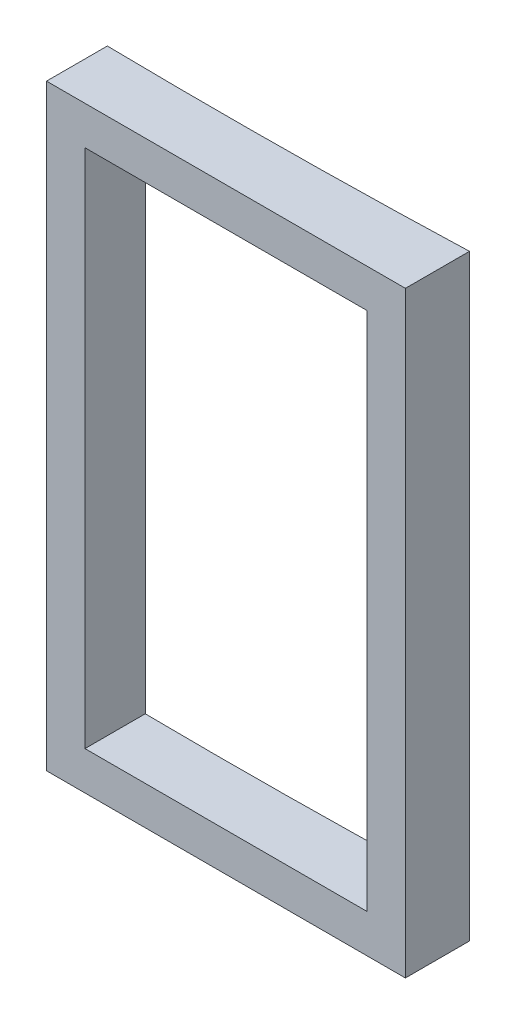
ISO-10303-21;
HEADER;
FILE_DESCRIPTION(('STEP AP214'),'2;1');
FILE_NAME('part.step','',(''),(''),'','','');
FILE_SCHEMA(('AUTOMOTIVE_DESIGN { 1 0 10303 214 1 1 1 1 }'));
ENDSEC;
DATA;
#1=APPLICATION_CONTEXT('core data for automotive mechanical design processes');
#2=APPLICATION_PROTOCOL_DEFINITION('international standard','automotive_design',2000,#1);
#3=PRODUCT_CONTEXT('',#1,'mechanical');
#4=PRODUCT('Part','Part','',(#3));
#5=PRODUCT_RELATED_PRODUCT_CATEGORY('part','',(#4));
#6=PRODUCT_DEFINITION_FORMATION('','',#4);
#7=PRODUCT_DEFINITION_CONTEXT('part definition',#1,'design');
#8=PRODUCT_DEFINITION('design','',#6,#7);
#9=PRODUCT_DEFINITION_SHAPE('','',#8);
#10=(LENGTH_UNIT() NAMED_UNIT(*) SI_UNIT(.MILLI.,.METRE.));
#11=(NAMED_UNIT(*) PLANE_ANGLE_UNIT() SI_UNIT($,.RADIAN.));
#12=(NAMED_UNIT(*) SI_UNIT($,.STERADIAN.) SOLID_ANGLE_UNIT());
#13=UNCERTAINTY_MEASURE_WITH_UNIT(LENGTH_MEASURE(1.E-05),#10,'distance_accuracy_value','');
#14=(GEOMETRIC_REPRESENTATION_CONTEXT(3) GLOBAL_UNCERTAINTY_ASSIGNED_CONTEXT((#13)) GLOBAL_UNIT_ASSIGNED_CONTEXT((#10,
#11,#12)) REPRESENTATION_CONTEXT('',''));
#15=CARTESIAN_POINT('',(0.,0.,0.));
#16=DIRECTION('',(0.,0.,1.));
#17=DIRECTION('',(1.,0.,0.));
#18=AXIS2_PLACEMENT_3D('',#15,#16,#17);
#19=CARTESIAN_POINT('',(-7642.18614314405,2330.,-22466.2180459366));
#20=DIRECTION('',(0.,-1.,0.));
#21=DIRECTION('',(0.,0.,-1.));
#22=AXIS2_PLACEMENT_3D('',#19,#20,#21);
#23=CYLINDRICAL_SURFACE('',#22,27500.);
#24=CARTESIAN_POINT('',(-7642.18614314405,150.,-22466.2180459366));
#25=DIRECTION('',(0.,-1.,0.));
#26=DIRECTION('',(1.,0.,0.));
#27=AXIS2_PLACEMENT_3D('',#24,#25,#26);
#28=CIRCLE('',#27,27500.);
#29=CARTESIAN_POINT('',(-7942.18614314405,150.,5032.14554173894));
#30=VERTEX_POINT('',#29);
#31=CARTESIAN_POINT('',(-6842.18614314405,150.,5022.14312747642));
#32=VERTEX_POINT('',#31);
#33=EDGE_CURVE('E136',#30,#32,#28,.F.);
#34=ORIENTED_EDGE('',*,*,#33,.T.);
#35=DIRECTION('',(0.,-1.,0.));
#36=VECTOR('',#35,1.);
#37=CARTESIAN_POINT('',(-6842.18614314405,2330.,5022.14312747642));
#38=LINE('',#37,#36);
#39=CARTESIAN_POINT('',(-6842.18614314405,2180.,5022.14312747642));
#40=VERTEX_POINT('',#39);
#41=EDGE_CURVE('E139',#32,#40,#38,.F.);
#42=ORIENTED_EDGE('',*,*,#41,.T.);
#43=CARTESIAN_POINT('',(-7642.18614314405,2180.,-22466.2180459366));
#44=DIRECTION('',(0.,1.,0.));
#45=DIRECTION('',(0.,0.,1.));
#46=AXIS2_PLACEMENT_3D('',#43,#44,#45);
#47=CIRCLE('',#46,27500.);
#48=CARTESIAN_POINT('',(-7942.18614314405,2180.,5032.14554173894));
#49=VERTEX_POINT('',#48);
#50=EDGE_CURVE('E131',#40,#49,#47,.F.);
#51=ORIENTED_EDGE('',*,*,#50,.T.);
#52=DIRECTION('',(0.,-1.,0.));
#53=VECTOR('',#52,1.);
#54=CARTESIAN_POINT('',(-7942.18614314405,2330.,5032.14554173894));
#55=LINE('',#54,#53);
#56=EDGE_CURVE('E111',#49,#30,#55,.T.);
#57=ORIENTED_EDGE('',*,*,#56,.T.);
#58=EDGE_LOOP('',(#34,#42,#51,#57));
#59=FACE_BOUND('',#58,.T.);
#60=CARTESIAN_POINT('',(-7642.18614314405,0.,-22466.2180459366));
#61=DIRECTION('',(0.,-1.,0.));
#62=DIRECTION('',(0.,0.,-1.));
#63=AXIS2_PLACEMENT_3D('',#60,#61,#62);
#64=CIRCLE('',#63,27500.);
#65=CARTESIAN_POINT('',(-6692.18614314405,0.,5017.36796462614));
#66=VERTEX_POINT('',#65);
#67=CARTESIAN_POINT('',(-8092.18614314405,0.,5030.09988937976));
#68=VERTEX_POINT('',#67);
#69=EDGE_CURVE('E142',#66,#68,#64,.T.);
#70=ORIENTED_EDGE('',*,*,#69,.T.);
#71=DIRECTION('',(0.,-1.,0.));
#72=VECTOR('',#71,1.);
#73=CARTESIAN_POINT('',(-8092.18614314405,2330.,5030.09988937976));
#74=LINE('',#73,#72);
#75=CARTESIAN_POINT('',(-8092.18614314405,2330.,5030.09988937976));
#76=VERTEX_POINT('',#75);
#77=EDGE_CURVE('E11',#76,#68,#74,.T.);
#78=ORIENTED_EDGE('',*,*,#77,.F.);
#79=CARTESIAN_POINT('',(-7642.18614314405,2330.,-22466.2180459366));
#80=DIRECTION('',(0.,-1.,0.));
#81=DIRECTION('',(0.,0.,-1.));
#82=AXIS2_PLACEMENT_3D('',#79,#80,#81);
#83=CIRCLE('',#82,27500.);
#84=CARTESIAN_POINT('',(-6692.18614314405,2330.,5017.36796462614));
#85=VERTEX_POINT('',#84);
#86=EDGE_CURVE('E143',#85,#76,#83,.T.);
#87=ORIENTED_EDGE('',*,*,#86,.F.);
#88=DIRECTION('',(0.,-1.,0.));
#89=VECTOR('',#88,1.);
#90=CARTESIAN_POINT('',(-6692.18614314405,2330.,5017.36796462614));
#91=LINE('',#90,#89);
#92=EDGE_CURVE('E153',#85,#66,#91,.T.);
#93=ORIENTED_EDGE('',*,*,#92,.T.);
#94=EDGE_LOOP('',(#70,#78,#87,#93));
#95=FACE_BOUND('',#94,.T.);
#96=ADVANCED_FACE('F41',(#59,#95),#23,.F.);
#97=CARTESIAN_POINT('',(-8092.18614314405,2330.,5030.09988937976));
#98=DIRECTION('',(1.,0.,0.));
#99=DIRECTION('',(0.,0.,-1.));
#100=AXIS2_PLACEMENT_3D('',#97,#98,#99);
#101=PLANE('',#100);
#102=DIRECTION('',(0.,0.,1.));
#103=VECTOR('',#102,1.);
#104=CARTESIAN_POINT('',(-8092.18614314405,0.,5030.09988937976));
#105=LINE('',#104,#103);
#106=CARTESIAN_POINT('',(-8092.18614314405,0.,5267.36796462614));
#107=VERTEX_POINT('',#106);
#108=EDGE_CURVE('E156',#68,#107,#105,.T.);
#109=ORIENTED_EDGE('',*,*,#108,.T.);
#110=DIRECTION('',(0.,-1.,0.));
#111=VECTOR('',#110,1.);
#112=CARTESIAN_POINT('',(-8092.18614314405,2330.,5267.36796462614));
#113=LINE('',#112,#111);
#114=CARTESIAN_POINT('',(-8092.18614314405,2330.,5267.36796462614));
#115=VERTEX_POINT('',#114);
#116=EDGE_CURVE('E48',#115,#107,#113,.T.);
#117=ORIENTED_EDGE('',*,*,#116,.F.);
#118=DIRECTION('',(0.,0.,1.));
#119=VECTOR('',#118,1.);
#120=CARTESIAN_POINT('',(-8092.18614314405,2330.,5030.09988937976));
#121=LINE('',#120,#119);
#122=EDGE_CURVE('E146',#76,#115,#121,.T.);
#123=ORIENTED_EDGE('',*,*,#122,.F.);
#124=ORIENTED_EDGE('',*,*,#77,.T.);
#125=EDGE_LOOP('',(#109,#117,#123,#124));
#126=FACE_BOUND('',#125,.T.);
#127=ADVANCED_FACE('F184',(#126),#101,.F.);
#128=CARTESIAN_POINT('',(-8092.18614314405,2330.,5267.36796462614));
#129=DIRECTION('',(0.,0.,-1.));
#130=DIRECTION('',(-1.,0.,0.));
#131=AXIS2_PLACEMENT_3D('',#128,#129,#130);
#132=PLANE('',#131);
#133=DIRECTION('',(-1.,0.,0.));
#134=VECTOR('',#133,1.);
#135=CARTESIAN_POINT('',(-7942.18614314405,2180.,5267.36796462614));
#136=LINE('',#135,#134);
#137=CARTESIAN_POINT('',(-6842.18614314405,2180.,5267.36796462614));
#138=VERTEX_POINT('',#137);
#139=CARTESIAN_POINT('',(-7942.18614314405,2180.,5267.36796462614));
#140=VERTEX_POINT('',#139);
#141=EDGE_CURVE('E117',#138,#140,#136,.T.);
#142=ORIENTED_EDGE('',*,*,#141,.F.);
#143=DIRECTION('',(0.,1.,0.));
#144=VECTOR('',#143,1.);
#145=CARTESIAN_POINT('',(-6842.18614314405,2180.,5267.36796462614));
#146=LINE('',#145,#144);
#147=CARTESIAN_POINT('',(-6842.18614314405,150.,5267.36796462614));
#148=VERTEX_POINT('',#147);
#149=EDGE_CURVE('E63',#148,#138,#146,.T.);
#150=ORIENTED_EDGE('',*,*,#149,.F.);
#151=DIRECTION('',(1.,0.,0.));
#152=VECTOR('',#151,1.);
#153=CARTESIAN_POINT('',(-6842.18614314405,150.,5267.36796462614));
#154=LINE('',#153,#152);
#155=CARTESIAN_POINT('',(-7942.18614314405,150.,5267.36796462614));
#156=VERTEX_POINT('',#155);
#157=EDGE_CURVE('E124',#156,#148,#154,.T.);
#158=ORIENTED_EDGE('',*,*,#157,.F.);
#159=DIRECTION('',(0.,-1.,0.));
#160=VECTOR('',#159,1.);
#161=CARTESIAN_POINT('',(-7942.18614314405,150.,5267.36796462614));
#162=LINE('',#161,#160);
#163=EDGE_CURVE('E108',#140,#156,#162,.T.);
#164=ORIENTED_EDGE('',*,*,#163,.F.);
#165=EDGE_LOOP('',(#142,#150,#158,#164));
#166=FACE_BOUND('',#165,.T.);
#167=DIRECTION('',(1.,0.,0.));
#168=VECTOR('',#167,1.);
#169=CARTESIAN_POINT('',(-8092.18614314405,0.,5267.36796462614));
#170=LINE('',#169,#168);
#171=CARTESIAN_POINT('',(-6692.18614314405,0.,5267.36796462614));
#172=VERTEX_POINT('',#171);
#173=EDGE_CURVE('E158',#107,#172,#170,.T.);
#174=ORIENTED_EDGE('',*,*,#173,.T.);
#175=DIRECTION('',(0.,-1.,0.));
#176=VECTOR('',#175,1.);
#177=CARTESIAN_POINT('',(-6692.18614314405,2330.,5267.36796462614));
#178=LINE('',#177,#176);
#179=CARTESIAN_POINT('',(-6692.18614314405,2330.,5267.36796462614));
#180=VERTEX_POINT('',#179);
#181=EDGE_CURVE('E163',#180,#172,#178,.T.);
#182=ORIENTED_EDGE('',*,*,#181,.F.);
#183=DIRECTION('',(1.,0.,0.));
#184=VECTOR('',#183,1.);
#185=CARTESIAN_POINT('',(-8092.18614314405,2330.,5267.36796462614));
#186=LINE('',#185,#184);
#187=EDGE_CURVE('E149',#115,#180,#186,.T.);
#188=ORIENTED_EDGE('',*,*,#187,.F.);
#189=ORIENTED_EDGE('',*,*,#116,.T.);
#190=EDGE_LOOP('',(#174,#182,#188,#189));
#191=FACE_BOUND('',#190,.T.);
#192=ADVANCED_FACE('F121',(#166,#191),#132,.F.);
#193=CARTESIAN_POINT('',(-6692.18614314405,2330.,5017.36796462614));
#194=DIRECTION('',(-1.,0.,0.));
#195=DIRECTION('',(0.,0.,1.));
#196=AXIS2_PLACEMENT_3D('',#193,#194,#195);
#197=PLANE('',#196);
#198=DIRECTION('',(0.,0.,-1.));
#199=VECTOR('',#198,1.);
#200=CARTESIAN_POINT('',(-6692.18614314405,0.,5017.36796462614));
#201=LINE('',#200,#199);
#202=EDGE_CURVE('E147',#172,#66,#201,.T.);
#203=ORIENTED_EDGE('',*,*,#202,.T.);
#204=ORIENTED_EDGE('',*,*,#92,.F.);
#205=DIRECTION('',(0.,0.,-1.));
#206=VECTOR('',#205,1.);
#207=CARTESIAN_POINT('',(-6692.18614314405,2330.,5017.36796462614));
#208=LINE('',#207,#206);
#209=EDGE_CURVE('E151',#180,#85,#208,.T.);
#210=ORIENTED_EDGE('',*,*,#209,.F.);
#211=ORIENTED_EDGE('',*,*,#181,.T.);
#212=EDGE_LOOP('',(#203,#204,#210,#211));
#213=FACE_BOUND('',#212,.T.);
#214=ADVANCED_FACE('F177',(#213),#197,.F.);
#215=CARTESIAN_POINT('',(-7642.18614314405,2330.,-22466.2180459366));
#216=DIRECTION('',(0.,-1.,0.));
#217=DIRECTION('',(0.,0.,-1.));
#218=AXIS2_PLACEMENT_3D('',#215,#216,#217);
#219=PLANE('',#218);
#220=ORIENTED_EDGE('',*,*,#86,.T.);
#221=ORIENTED_EDGE('',*,*,#122,.T.);
#222=ORIENTED_EDGE('',*,*,#187,.T.);
#223=ORIENTED_EDGE('',*,*,#209,.T.);
#224=EDGE_LOOP('',(#220,#221,#222,#223));
#225=FACE_BOUND('',#224,.T.);
#226=ADVANCED_FACE('F183',(#225),#219,.F.);
#227=CARTESIAN_POINT('',(-7642.18614314405,0.,-22466.2180459366));
#228=DIRECTION('',(0.,-1.,0.));
#229=DIRECTION('',(0.,0.,-1.));
#230=AXIS2_PLACEMENT_3D('',#227,#228,#229);
#231=PLANE('',#230);
#232=ORIENTED_EDGE('',*,*,#69,.F.);
#233=ORIENTED_EDGE('',*,*,#202,.F.);
#234=ORIENTED_EDGE('',*,*,#173,.F.);
#235=ORIENTED_EDGE('',*,*,#108,.F.);
#236=EDGE_LOOP('',(#232,#233,#234,#235));
#237=FACE_BOUND('',#236,.T.);
#238=ADVANCED_FACE('F174',(#237),#231,.T.);
#239=CARTESIAN_POINT('',(-6842.18614314405,2180.,2267.36796462614));
#240=DIRECTION('',(1.,0.,0.));
#241=DIRECTION('',(0.,0.,-1.));
#242=AXIS2_PLACEMENT_3D('',#239,#240,#241);
#243=PLANE('',#242);
#244=DIRECTION('',(0.,0.,1.));
#245=VECTOR('',#244,1.);
#246=CARTESIAN_POINT('',(-6842.18614314405,150.,2267.36796462614));
#247=LINE('',#246,#245);
#248=EDGE_CURVE('E129',#32,#148,#247,.T.);
#249=ORIENTED_EDGE('',*,*,#248,.T.);
#250=ORIENTED_EDGE('',*,*,#149,.T.);
#251=DIRECTION('',(0.,0.,1.));
#252=VECTOR('',#251,1.);
#253=CARTESIAN_POINT('',(-6842.18614314405,2180.,2267.36796462614));
#254=LINE('',#253,#252);
#255=EDGE_CURVE('E114',#40,#138,#254,.T.);
#256=ORIENTED_EDGE('',*,*,#255,.F.);
#257=ORIENTED_EDGE('',*,*,#41,.F.);
#258=EDGE_LOOP('',(#249,#250,#256,#257));
#259=FACE_BOUND('',#258,.T.);
#260=ADVANCED_FACE('F197',(#259),#243,.F.);
#261=CARTESIAN_POINT('',(-6842.18614314405,150.,2267.36796462614));
#262=DIRECTION('',(0.,-1.,0.));
#263=DIRECTION('',(1.,0.,0.));
#264=AXIS2_PLACEMENT_3D('',#261,#262,#263);
#265=PLANE('',#264);
#266=DIRECTION('',(0.,0.,1.));
#267=VECTOR('',#266,1.);
#268=CARTESIAN_POINT('',(-7942.18614314405,150.,2267.36796462614));
#269=LINE('',#268,#267);
#270=EDGE_CURVE('E113',#30,#156,#269,.T.);
#271=ORIENTED_EDGE('',*,*,#270,.T.);
#272=ORIENTED_EDGE('',*,*,#157,.T.);
#273=ORIENTED_EDGE('',*,*,#248,.F.);
#274=ORIENTED_EDGE('',*,*,#33,.F.);
#275=EDGE_LOOP('',(#271,#272,#273,#274));
#276=FACE_BOUND('',#275,.T.);
#277=ADVANCED_FACE('F202',(#276),#265,.F.);
#278=CARTESIAN_POINT('',(-7942.18614314405,150.,2267.36796462614));
#279=DIRECTION('',(-1.,0.,0.));
#280=DIRECTION('',(0.,0.,1.));
#281=AXIS2_PLACEMENT_3D('',#278,#279,#280);
#282=PLANE('',#281);
#283=DIRECTION('',(0.,0.,1.));
#284=VECTOR('',#283,1.);
#285=CARTESIAN_POINT('',(-7942.18614314405,2180.,2267.36796462614));
#286=LINE('',#285,#284);
#287=EDGE_CURVE('E55',#49,#140,#286,.T.);
#288=ORIENTED_EDGE('',*,*,#287,.T.);
#289=ORIENTED_EDGE('',*,*,#163,.T.);
#290=ORIENTED_EDGE('',*,*,#270,.F.);
#291=ORIENTED_EDGE('',*,*,#56,.F.);
#292=EDGE_LOOP('',(#288,#289,#290,#291));
#293=FACE_BOUND('',#292,.T.);
#294=ADVANCED_FACE('F105',(#293),#282,.F.);
#295=CARTESIAN_POINT('',(-7942.18614314405,2180.,2267.36796462614));
#296=DIRECTION('',(0.,1.,0.));
#297=DIRECTION('',(0.,0.,1.));
#298=AXIS2_PLACEMENT_3D('',#295,#296,#297);
#299=PLANE('',#298);
#300=ORIENTED_EDGE('',*,*,#255,.T.);
#301=ORIENTED_EDGE('',*,*,#141,.T.);
#302=ORIENTED_EDGE('',*,*,#287,.F.);
#303=ORIENTED_EDGE('',*,*,#50,.F.);
#304=EDGE_LOOP('',(#300,#301,#302,#303));
#305=FACE_BOUND('',#304,.T.);
#306=ADVANCED_FACE('F118',(#305),#299,.F.);
#307=CLOSED_SHELL('',(#96,#127,#192,#214,#226,#238,#260,#277,#294,#306));
#308=MANIFOLD_SOLID_BREP('B2',#307);
#309=ADVANCED_BREP_SHAPE_REPRESENTATION('',(#18,#308),#14);
#310=SHAPE_DEFINITION_REPRESENTATION(#9,#309);
ENDSEC;
END-ISO-10303-21;
